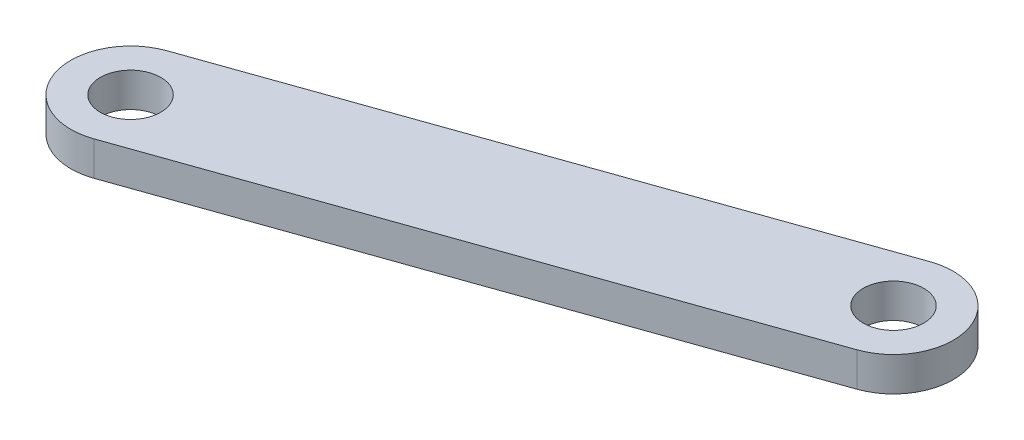
ISO-10303-21;
HEADER;
FILE_DESCRIPTION(('STEP AP214'),'2;1');
FILE_NAME('part.step','',(''),(''),'','','');
FILE_SCHEMA(('AUTOMOTIVE_DESIGN { 1 0 10303 214 1 1 1 1 }'));
ENDSEC;
DATA;
#1=APPLICATION_CONTEXT('core data for automotive mechanical design processes');
#2=APPLICATION_PROTOCOL_DEFINITION('international standard','automotive_design',2000,#1);
#3=PRODUCT_CONTEXT('',#1,'mechanical');
#4=PRODUCT('Part','Part','',(#3));
#5=PRODUCT_RELATED_PRODUCT_CATEGORY('part','',(#4));
#6=PRODUCT_DEFINITION_FORMATION('','',#4);
#7=PRODUCT_DEFINITION_CONTEXT('part definition',#1,'design');
#8=PRODUCT_DEFINITION('design','',#6,#7);
#9=PRODUCT_DEFINITION_SHAPE('','',#8);
#10=(LENGTH_UNIT() NAMED_UNIT(*) SI_UNIT(.MILLI.,.METRE.));
#11=(NAMED_UNIT(*) PLANE_ANGLE_UNIT() SI_UNIT($,.RADIAN.));
#12=(NAMED_UNIT(*) SI_UNIT($,.STERADIAN.) SOLID_ANGLE_UNIT());
#13=UNCERTAINTY_MEASURE_WITH_UNIT(LENGTH_MEASURE(1.E-05),#10,'distance_accuracy_value','');
#14=(GEOMETRIC_REPRESENTATION_CONTEXT(3) GLOBAL_UNCERTAINTY_ASSIGNED_CONTEXT((#13)) GLOBAL_UNIT_ASSIGNED_CONTEXT((#10,
#11,#12)) REPRESENTATION_CONTEXT('',''));
#15=CARTESIAN_POINT('',(0.,0.,0.));
#16=DIRECTION('',(0.,0.,1.));
#17=DIRECTION('',(1.,0.,0.));
#18=AXIS2_PLACEMENT_3D('',#15,#16,#17);
#19=CARTESIAN_POINT('',(-5.03026924549877,1.27,-27.474676265174));
#20=DIRECTION('',(0.,-1.,0.));
#21=DIRECTION('',(0.,0.,-1.));
#22=AXIS2_PLACEMENT_3D('',#19,#20,#21);
#23=CYLINDRICAL_SURFACE('',#22,4.445);
#24=CARTESIAN_POINT('',(-5.03026924549877,-1.27,-27.474676265174));
#25=DIRECTION('',(0.,1.,0.));
#26=DIRECTION('',(0.,0.,1.));
#27=AXIS2_PLACEMENT_3D('',#24,#25,#26);
#28=CIRCLE('',#27,4.445);
#29=CARTESIAN_POINT('',(-6.50773687201618,-1.27,-31.6669446741136));
#30=VERTEX_POINT('',#29);
#31=CARTESIAN_POINT('',(-3.55280161898139,-1.27,-23.2824078562344));
#32=VERTEX_POINT('',#31);
#33=EDGE_CURVE('E108',#30,#32,#28,.F.);
#34=ORIENTED_EDGE('',*,*,#33,.F.);
#35=DIRECTION('',(0.,-1.,0.));
#36=VECTOR('',#35,1.);
#37=CARTESIAN_POINT('',(-6.50773687201618,1.27,-31.6669446741136));
#38=LINE('',#37,#36);
#39=CARTESIAN_POINT('',(-6.50773687201618,1.27,-31.6669446741136));
#40=VERTEX_POINT('',#39);
#41=EDGE_CURVE('E11',#40,#30,#38,.T.);
#42=ORIENTED_EDGE('',*,*,#41,.F.);
#43=CARTESIAN_POINT('',(-5.03026924549877,1.27,-27.474676265174));
#44=DIRECTION('',(0.,1.,0.));
#45=DIRECTION('',(0.,0.,1.));
#46=AXIS2_PLACEMENT_3D('',#43,#44,#45);
#47=CIRCLE('',#46,4.445);
#48=CARTESIAN_POINT('',(-3.55280161898139,1.27,-23.2824078562344));
#49=VERTEX_POINT('',#48);
#50=EDGE_CURVE('E89',#40,#49,#47,.F.);
#51=ORIENTED_EDGE('',*,*,#50,.T.);
#52=DIRECTION('',(0.,-1.,0.));
#53=VECTOR('',#52,1.);
#54=CARTESIAN_POINT('',(-3.55280161898139,1.27,-23.2824078562344));
#55=LINE('',#54,#53);
#56=EDGE_CURVE('E57',#49,#32,#55,.T.);
#57=ORIENTED_EDGE('',*,*,#56,.T.);
#58=EDGE_LOOP('',(#34,#42,#51,#57));
#59=FACE_BOUND('',#58,.T.);
#60=ADVANCED_FACE('F40',(#59),#23,.T.);
#61=CARTESIAN_POINT('',(-10.6462558942942,1.27,-30.208419770483));
#62=DIRECTION('',(0.332388667382992,0.,0.943142499199012));
#63=DIRECTION('',(0.943142499199012,0.,-0.332388667382992));
#64=AXIS2_PLACEMENT_3D('',#61,#62,#63);
#65=PLANE('',#64);
#66=DIRECTION('',(-0.943142499199012,0.,0.332388667382992));
#67=VECTOR('',#66,1.);
#68=CARTESIAN_POINT('',(-10.6462558942942,-1.27,-30.208419770483));
#69=LINE('',#68,#67);
#70=CARTESIAN_POINT('',(-48.4304209614123,-1.27,-16.8922684089396));
#71=VERTEX_POINT('',#70);
#72=EDGE_CURVE('E96',#30,#71,#69,.T.);
#73=ORIENTED_EDGE('',*,*,#72,.T.);
#74=DIRECTION('',(0.,-1.,0.));
#75=VECTOR('',#74,1.);
#76=CARTESIAN_POINT('',(-48.4304209614123,1.27,-16.8922684089396));
#77=LINE('',#76,#75);
#78=CARTESIAN_POINT('',(-48.4304209614123,1.27,-16.8922684089396));
#79=VERTEX_POINT('',#78);
#80=EDGE_CURVE('E49',#79,#71,#77,.T.);
#81=ORIENTED_EDGE('',*,*,#80,.F.);
#82=DIRECTION('',(-0.943142499199012,0.,0.332388667382992));
#83=VECTOR('',#82,1.);
#84=CARTESIAN_POINT('',(-10.6462558942942,1.27,-30.208419770483));
#85=LINE('',#84,#83);
#86=EDGE_CURVE('E83',#40,#79,#85,.T.);
#87=ORIENTED_EDGE('',*,*,#86,.F.);
#88=ORIENTED_EDGE('',*,*,#41,.T.);
#89=EDGE_LOOP('',(#73,#81,#87,#88));
#90=FACE_BOUND('',#89,.T.);
#91=ADVANCED_FACE('F94',(#90),#65,.F.);
#92=CARTESIAN_POINT('',(-46.9529533348949,1.27,-12.7));
#93=DIRECTION('',(0.,-1.,0.));
#94=DIRECTION('',(0.,0.,-1.));
#95=AXIS2_PLACEMENT_3D('',#92,#93,#94);
#96=CYLINDRICAL_SURFACE('',#95,4.445);
#97=CARTESIAN_POINT('',(-46.9529533348949,-1.27,-12.7));
#98=DIRECTION('',(0.,1.,0.));
#99=DIRECTION('',(0.,0.,1.));
#100=AXIS2_PLACEMENT_3D('',#97,#98,#99);
#101=CIRCLE('',#100,4.445);
#102=CARTESIAN_POINT('',(-45.4754857083775,-1.27,-8.50773159106039));
#103=VERTEX_POINT('',#102);
#104=EDGE_CURVE('E114',#71,#103,#101,.T.);
#105=ORIENTED_EDGE('',*,*,#104,.T.);
#106=DIRECTION('',(0.,-1.,0.));
#107=VECTOR('',#106,1.);
#108=CARTESIAN_POINT('',(-45.4754857083775,1.27,-8.50773159106039));
#109=LINE('',#108,#107);
#110=CARTESIAN_POINT('',(-45.4754857083775,1.27,-8.50773159106039));
#111=VERTEX_POINT('',#110);
#112=EDGE_CURVE('E71',#111,#103,#109,.T.);
#113=ORIENTED_EDGE('',*,*,#112,.F.);
#114=CARTESIAN_POINT('',(-46.9529533348949,1.27,-12.7));
#115=DIRECTION('',(0.,1.,0.));
#116=DIRECTION('',(0.,0.,1.));
#117=AXIS2_PLACEMENT_3D('',#114,#115,#116);
#118=CIRCLE('',#117,4.445);
#119=EDGE_CURVE('E88',#79,#111,#118,.T.);
#120=ORIENTED_EDGE('',*,*,#119,.F.);
#121=ORIENTED_EDGE('',*,*,#80,.T.);
#122=EDGE_LOOP('',(#105,#113,#120,#121));
#123=FACE_BOUND('',#122,.T.);
#124=ADVANCED_FACE('F100',(#123),#96,.T.);
#125=CARTESIAN_POINT('',(-7.69132064125945,1.27,-21.8238829526038));
#126=DIRECTION('',(0.332388667382992,0.,0.943142499199012));
#127=DIRECTION('',(0.943142499199012,0.,-0.332388667382992));
#128=AXIS2_PLACEMENT_3D('',#125,#126,#127);
#129=PLANE('',#128);
#130=DIRECTION('',(-0.943142499199012,0.,0.332388667382992));
#131=VECTOR('',#130,1.);
#132=CARTESIAN_POINT('',(-7.69132064125945,-1.27,-21.8238829526038));
#133=LINE('',#132,#131);
#134=EDGE_CURVE('E117',#32,#103,#133,.T.);
#135=ORIENTED_EDGE('',*,*,#134,.F.);
#136=ORIENTED_EDGE('',*,*,#56,.F.);
#137=DIRECTION('',(-0.943142499199012,0.,0.332388667382992));
#138=VECTOR('',#137,1.);
#139=CARTESIAN_POINT('',(-7.69132064125945,1.27,-21.8238829526038));
#140=LINE('',#139,#138);
#141=EDGE_CURVE('E102',#49,#111,#140,.T.);
#142=ORIENTED_EDGE('',*,*,#141,.T.);
#143=ORIENTED_EDGE('',*,*,#112,.T.);
#144=EDGE_LOOP('',(#135,#136,#142,#143));
#145=FACE_BOUND('',#144,.T.);
#146=ADVANCED_FACE('F149',(#145),#129,.T.);
#147=CARTESIAN_POINT('',(0.,1.27,0.));
#148=DIRECTION('',(0.,1.,0.));
#149=DIRECTION('',(0.,0.,1.));
#150=AXIS2_PLACEMENT_3D('',#147,#148,#149);
#151=PLANE('',#150);
#152=CARTESIAN_POINT('',(-5.03026924549878,1.27,-27.474676265174));
#153=DIRECTION('',(0.,1.,0.));
#154=DIRECTION('',(0.,0.,1.));
#155=AXIS2_PLACEMENT_3D('',#152,#153,#154);
#156=CIRCLE('',#155,2.2479);
#157=CARTESIAN_POINT('',(-5.03026924549878,1.27,-25.226776265174));
#158=VERTEX_POINT('',#157);
#159=EDGE_CURVE('E131',#158,#158,#156,.T.);
#160=ORIENTED_EDGE('',*,*,#159,.F.);
#161=EDGE_LOOP('',(#160));
#162=FACE_BOUND('',#161,.T.);
#163=CARTESIAN_POINT('',(-46.9529533348949,1.27,-12.7));
#164=DIRECTION('',(0.,1.,0.));
#165=DIRECTION('',(0.,0.,1.));
#166=AXIS2_PLACEMENT_3D('',#163,#164,#165);
#167=CIRCLE('',#166,2.2479);
#168=CARTESIAN_POINT('',(-46.9529533348949,1.27,-10.4521));
#169=VERTEX_POINT('',#168);
#170=EDGE_CURVE('E132',#169,#169,#167,.T.);
#171=ORIENTED_EDGE('',*,*,#170,.F.);
#172=EDGE_LOOP('',(#171));
#173=FACE_BOUND('',#172,.T.);
#174=ORIENTED_EDGE('',*,*,#50,.F.);
#175=ORIENTED_EDGE('',*,*,#86,.T.);
#176=ORIENTED_EDGE('',*,*,#119,.T.);
#177=ORIENTED_EDGE('',*,*,#141,.F.);
#178=EDGE_LOOP('',(#174,#175,#176,#177));
#179=FACE_BOUND('',#178,.T.);
#180=ADVANCED_FACE('F85',(#162,#173,#179),#151,.T.);
#181=CARTESIAN_POINT('',(0.,-1.27,0.));
#182=DIRECTION('',(0.,1.,0.));
#183=DIRECTION('',(0.,0.,1.));
#184=AXIS2_PLACEMENT_3D('',#181,#182,#183);
#185=PLANE('',#184);
#186=CARTESIAN_POINT('',(-5.03026924549878,-1.27,-27.474676265174));
#187=DIRECTION('',(0.,1.,0.));
#188=DIRECTION('',(0.,0.,1.));
#189=AXIS2_PLACEMENT_3D('',#186,#187,#188);
#190=CIRCLE('',#189,2.2479);
#191=CARTESIAN_POINT('',(-5.03026924549878,-1.27,-25.226776265174));
#192=VERTEX_POINT('',#191);
#193=EDGE_CURVE('E111',#192,#192,#190,.F.);
#194=ORIENTED_EDGE('',*,*,#193,.F.);
#195=EDGE_LOOP('',(#194));
#196=FACE_BOUND('',#195,.T.);
#197=CARTESIAN_POINT('',(-46.9529533348949,-1.27,-12.7));
#198=DIRECTION('',(0.,1.,0.));
#199=DIRECTION('',(0.,0.,1.));
#200=AXIS2_PLACEMENT_3D('',#197,#198,#199);
#201=CIRCLE('',#200,2.2479);
#202=CARTESIAN_POINT('',(-46.9529533348949,-1.27,-10.4521));
#203=VERTEX_POINT('',#202);
#204=EDGE_CURVE('E127',#203,#203,#201,.F.);
#205=ORIENTED_EDGE('',*,*,#204,.F.);
#206=EDGE_LOOP('',(#205));
#207=FACE_BOUND('',#206,.T.);
#208=ORIENTED_EDGE('',*,*,#33,.T.);
#209=ORIENTED_EDGE('',*,*,#134,.T.);
#210=ORIENTED_EDGE('',*,*,#104,.F.);
#211=ORIENTED_EDGE('',*,*,#72,.F.);
#212=EDGE_LOOP('',(#208,#209,#210,#211));
#213=FACE_BOUND('',#212,.T.);
#214=ADVANCED_FACE('F148',(#196,#207,#213),#185,.F.);
#215=CARTESIAN_POINT('',(-46.9529533348949,-1.271,-12.7));
#216=DIRECTION('',(0.,1.,0.));
#217=DIRECTION('',(0.,0.,1.));
#218=AXIS2_PLACEMENT_3D('',#215,#216,#217);
#219=CYLINDRICAL_SURFACE('',#218,2.2479);
#220=ORIENTED_EDGE('',*,*,#170,.T.);
#221=EDGE_LOOP('',(#220));
#222=FACE_BOUND('',#221,.T.);
#223=ORIENTED_EDGE('',*,*,#204,.T.);
#224=EDGE_LOOP('',(#223));
#225=FACE_BOUND('',#224,.T.);
#226=ADVANCED_FACE('F153',(#222,#225),#219,.F.);
#227=CARTESIAN_POINT('',(-5.03026924549878,-1.271,-27.474676265174));
#228=DIRECTION('',(0.,1.,0.));
#229=DIRECTION('',(0.,0.,1.));
#230=AXIS2_PLACEMENT_3D('',#227,#228,#229);
#231=CYLINDRICAL_SURFACE('',#230,2.2479);
#232=ORIENTED_EDGE('',*,*,#159,.T.);
#233=EDGE_LOOP('',(#232));
#234=FACE_BOUND('',#233,.T.);
#235=ORIENTED_EDGE('',*,*,#193,.T.);
#236=EDGE_LOOP('',(#235));
#237=FACE_BOUND('',#236,.T.);
#238=ADVANCED_FACE('F143',(#234,#237),#231,.F.);
#239=CLOSED_SHELL('',(#60,#91,#124,#146,#180,#214,#226,#238));
#240=MANIFOLD_SOLID_BREP('B2',#239);
#241=ADVANCED_BREP_SHAPE_REPRESENTATION('',(#18,#240),#14);
#242=SHAPE_DEFINITION_REPRESENTATION(#9,#241);
ENDSEC;
END-ISO-10303-21;
